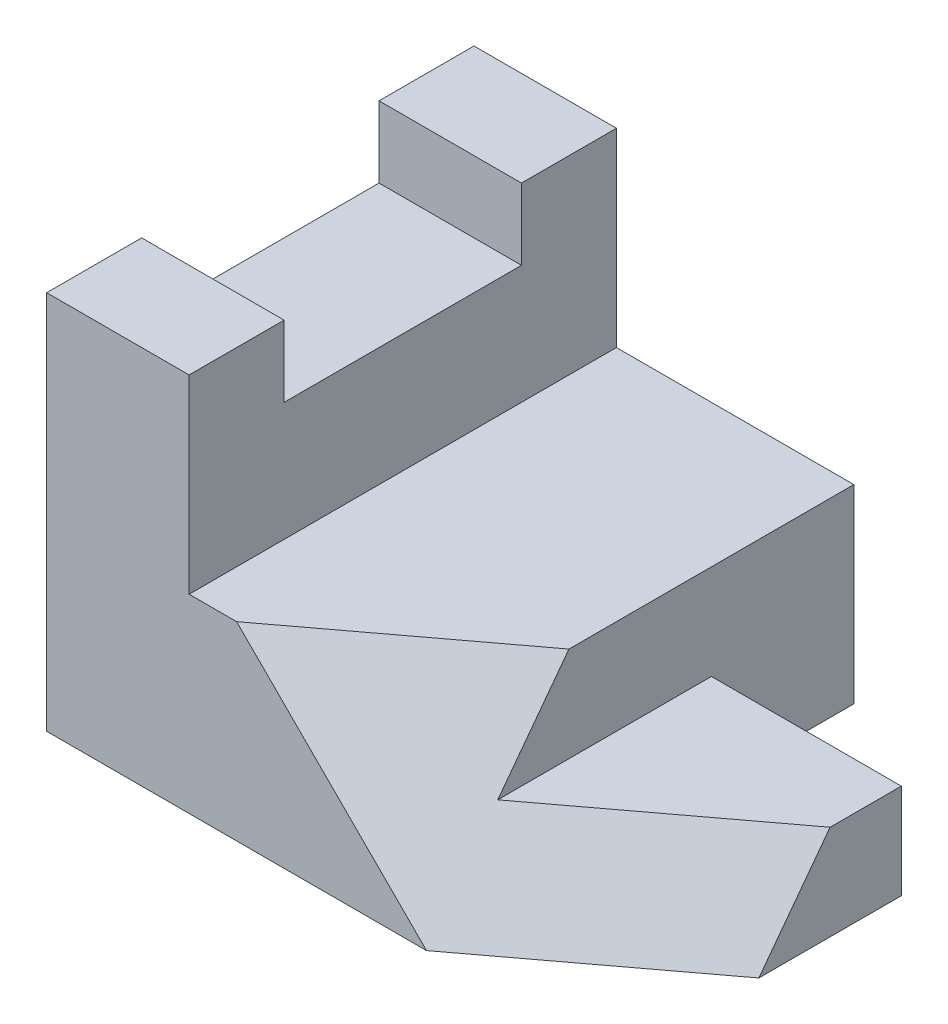
ISO-10303-21;
HEADER;
FILE_DESCRIPTION(('STEP AP214'),'2;1');
FILE_NAME('part.step','',(''),(''),'','','');
FILE_SCHEMA(('AUTOMOTIVE_DESIGN { 1 0 10303 214 1 1 1 1 }'));
ENDSEC;
DATA;
#1=APPLICATION_CONTEXT('core data for automotive mechanical design processes');
#2=APPLICATION_PROTOCOL_DEFINITION('international standard','automotive_design',2000,#1);
#3=PRODUCT_CONTEXT('',#1,'mechanical');
#4=PRODUCT('Part','Part','',(#3));
#5=PRODUCT_RELATED_PRODUCT_CATEGORY('part','',(#4));
#6=PRODUCT_DEFINITION_FORMATION('','',#4);
#7=PRODUCT_DEFINITION_CONTEXT('part definition',#1,'design');
#8=PRODUCT_DEFINITION('design','',#6,#7);
#9=PRODUCT_DEFINITION_SHAPE('','',#8);
#10=(LENGTH_UNIT() NAMED_UNIT(*) SI_UNIT(.MILLI.,.METRE.));
#11=(NAMED_UNIT(*) PLANE_ANGLE_UNIT() SI_UNIT($,.RADIAN.));
#12=(NAMED_UNIT(*) SI_UNIT($,.STERADIAN.) SOLID_ANGLE_UNIT());
#13=UNCERTAINTY_MEASURE_WITH_UNIT(LENGTH_MEASURE(1.E-05),#10,'distance_accuracy_value','');
#14=(GEOMETRIC_REPRESENTATION_CONTEXT(3) GLOBAL_UNCERTAINTY_ASSIGNED_CONTEXT((#13)) GLOBAL_UNIT_ASSIGNED_CONTEXT((#10,
#11,#12)) REPRESENTATION_CONTEXT('',''));
#15=CARTESIAN_POINT('',(0.,0.,0.));
#16=DIRECTION('',(0.,0.,1.));
#17=DIRECTION('',(1.,0.,0.));
#18=AXIS2_PLACEMENT_3D('',#15,#16,#17);
#19=CARTESIAN_POINT('',(-57.15,0.,57.15));
#20=DIRECTION('',(0.,0.,1.));
#21=DIRECTION('',(1.,0.,0.));
#22=AXIS2_PLACEMENT_3D('',#19,#20,#21);
#23=PLANE('',#22);
#24=DIRECTION('',(1.,0.,0.));
#25=VECTOR('',#24,1.);
#26=CARTESIAN_POINT('',(-57.15,0.,57.15));
#27=LINE('',#26,#25);
#28=CARTESIAN_POINT('',(-76.2,0.,57.15));
#29=VERTEX_POINT('',#28);
#30=CARTESIAN_POINT('',(-25.4,0.,57.15));
#31=VERTEX_POINT('',#30);
#32=EDGE_CURVE('E138',#29,#31,#27,.T.);
#33=ORIENTED_EDGE('',*,*,#32,.T.);
#34=DIRECTION('',(-0.707106781186548,0.707106781186548,0.));
#35=VECTOR('',#34,1.);
#36=CARTESIAN_POINT('',(-41.275,15.875,57.15));
#37=LINE('',#36,#35);
#38=CARTESIAN_POINT('',(-50.8,25.4,57.15));
#39=VERTEX_POINT('',#38);
#40=EDGE_CURVE('E59',#31,#39,#37,.T.);
#41=ORIENTED_EDGE('',*,*,#40,.T.);
#42=DIRECTION('',(1.,0.,0.));
#43=VECTOR('',#42,1.);
#44=CARTESIAN_POINT('',(-57.15,25.4,57.15));
#45=LINE('',#44,#43);
#46=CARTESIAN_POINT('',(-57.15,25.4,57.15));
#47=VERTEX_POINT('',#46);
#48=EDGE_CURVE('E225',#47,#39,#45,.T.);
#49=ORIENTED_EDGE('',*,*,#48,.F.);
#50=DIRECTION('',(0.,1.,0.));
#51=VECTOR('',#50,1.);
#52=CARTESIAN_POINT('',(-57.15,0.,57.15));
#53=LINE('',#52,#51);
#54=CARTESIAN_POINT('',(-57.15,50.8,57.15));
#55=VERTEX_POINT('',#54);
#56=EDGE_CURVE('E184',#47,#55,#53,.T.);
#57=ORIENTED_EDGE('',*,*,#56,.T.);
#58=DIRECTION('',(1.,0.,0.));
#59=VECTOR('',#58,1.);
#60=CARTESIAN_POINT('',(-76.2,50.8,57.15));
#61=LINE('',#60,#59);
#62=CARTESIAN_POINT('',(-76.2,50.8,57.15));
#63=VERTEX_POINT('',#62);
#64=EDGE_CURVE('E153',#63,#55,#61,.T.);
#65=ORIENTED_EDGE('',*,*,#64,.F.);
#66=DIRECTION('',(0.,1.,0.));
#67=VECTOR('',#66,1.);
#68=CARTESIAN_POINT('',(-76.2,0.,57.15));
#69=LINE('',#68,#67);
#70=EDGE_CURVE('E151',#29,#63,#69,.T.);
#71=ORIENTED_EDGE('',*,*,#70,.F.);
#72=EDGE_LOOP('',(#33,#41,#49,#57,#65,#71));
#73=FACE_BOUND('',#72,.T.);
#74=ADVANCED_FACE('F36',(#73),#23,.T.);
#75=CARTESIAN_POINT('',(-57.15,25.4,57.15));
#76=DIRECTION('',(0.,1.,0.));
#77=DIRECTION('',(0.,0.,1.));
#78=AXIS2_PLACEMENT_3D('',#75,#76,#77);
#79=PLANE('',#78);
#80=DIRECTION('',(0.8,0.,-0.6));
#81=VECTOR('',#80,1.);
#82=CARTESIAN_POINT('',(-54.864,25.4,60.198));
#83=LINE('',#82,#81);
#84=CARTESIAN_POINT('',(-25.4,25.4,38.1));
#85=VERTEX_POINT('',#84);
#86=EDGE_CURVE('E194',#39,#85,#83,.T.);
#87=ORIENTED_EDGE('',*,*,#86,.T.);
#88=DIRECTION('',(0.,0.,1.));
#89=VECTOR('',#88,1.);
#90=CARTESIAN_POINT('',(-25.4,25.4,0.));
#91=LINE('',#90,#89);
#92=CARTESIAN_POINT('',(-25.4,25.4,0.));
#93=VERTEX_POINT('',#92);
#94=EDGE_CURVE('E198',#93,#85,#91,.T.);
#95=ORIENTED_EDGE('',*,*,#94,.F.);
#96=DIRECTION('',(1.,0.,0.));
#97=VECTOR('',#96,1.);
#98=CARTESIAN_POINT('',(-57.15,25.4,0.));
#99=LINE('',#98,#97);
#100=CARTESIAN_POINT('',(-57.15,25.4,0.));
#101=VERTEX_POINT('',#100);
#102=EDGE_CURVE('E223',#101,#93,#99,.T.);
#103=ORIENTED_EDGE('',*,*,#102,.F.);
#104=DIRECTION('',(0.,0.,1.));
#105=VECTOR('',#104,1.);
#106=CARTESIAN_POINT('',(-57.15,25.4,57.15));
#107=LINE('',#106,#105);
#108=EDGE_CURVE('E148',#101,#47,#107,.T.);
#109=ORIENTED_EDGE('',*,*,#108,.T.);
#110=ORIENTED_EDGE('',*,*,#48,.T.);
#111=EDGE_LOOP('',(#87,#95,#103,#109,#110));
#112=FACE_BOUND('',#111,.T.);
#113=ADVANCED_FACE('F246',(#112),#79,.T.);
#114=CARTESIAN_POINT('',(-57.15,0.,57.15));
#115=DIRECTION('',(0.,-1.,0.));
#116=DIRECTION('',(0.,0.,-1.));
#117=AXIS2_PLACEMENT_3D('',#114,#115,#116);
#118=PLANE('',#117);
#119=DIRECTION('',(0.,0.,-1.));
#120=VECTOR('',#119,1.);
#121=CARTESIAN_POINT('',(0.,0.,57.15));
#122=LINE('',#121,#120);
#123=CARTESIAN_POINT('',(0.,0.,38.1));
#124=VERTEX_POINT('',#123);
#125=CARTESIAN_POINT('',(0.,0.,19.05));
#126=VERTEX_POINT('',#125);
#127=EDGE_CURVE('E210',#124,#126,#122,.T.);
#128=ORIENTED_EDGE('',*,*,#127,.F.);
#129=DIRECTION('',(-0.8,0.,0.6));
#130=VECTOR('',#129,1.);
#131=CARTESIAN_POINT('',(-45.72,0.,72.39));
#132=LINE('',#131,#130);
#133=EDGE_CURVE('E146',#124,#31,#132,.T.);
#134=ORIENTED_EDGE('',*,*,#133,.T.);
#135=ORIENTED_EDGE('',*,*,#32,.F.);
#136=DIRECTION('',(0.,0.,1.));
#137=VECTOR('',#136,1.);
#138=CARTESIAN_POINT('',(-76.2,0.,0.));
#139=LINE('',#138,#137);
#140=CARTESIAN_POINT('',(-76.2,0.,0.));
#141=VERTEX_POINT('',#140);
#142=EDGE_CURVE('E144',#141,#29,#139,.T.);
#143=ORIENTED_EDGE('',*,*,#142,.F.);
#144=DIRECTION('',(1.,0.,0.));
#145=VECTOR('',#144,1.);
#146=CARTESIAN_POINT('',(-57.15,0.,0.));
#147=LINE('',#146,#145);
#148=CARTESIAN_POINT('',(-25.4,0.,0.));
#149=VERTEX_POINT('',#148);
#150=EDGE_CURVE('E147',#141,#149,#147,.T.);
#151=ORIENTED_EDGE('',*,*,#150,.T.);
#152=DIRECTION('',(0.,0.,1.));
#153=VECTOR('',#152,1.);
#154=CARTESIAN_POINT('',(-25.4,0.,0.));
#155=LINE('',#154,#153);
#156=CARTESIAN_POINT('',(-25.4,0.,19.05));
#157=VERTEX_POINT('',#156);
#158=EDGE_CURVE('E199',#149,#157,#155,.T.);
#159=ORIENTED_EDGE('',*,*,#158,.T.);
#160=DIRECTION('',(1.,0.,0.));
#161=VECTOR('',#160,1.);
#162=CARTESIAN_POINT('',(0.,0.,19.05));
#163=LINE('',#162,#161);
#164=EDGE_CURVE('E202',#157,#126,#163,.T.);
#165=ORIENTED_EDGE('',*,*,#164,.T.);
#166=EDGE_LOOP('',(#128,#134,#135,#143,#151,#159,#165));
#167=FACE_BOUND('',#166,.T.);
#168=ADVANCED_FACE('F141',(#167),#118,.T.);
#169=CARTESIAN_POINT('',(0.,0.,0.));
#170=DIRECTION('',(-1.,0.,0.));
#171=DIRECTION('',(0.,0.,1.));
#172=AXIS2_PLACEMENT_3D('',#169,#170,#171);
#173=PLANE('',#172);
#174=DIRECTION('',(0.,1.,0.));
#175=VECTOR('',#174,1.);
#176=CARTESIAN_POINT('',(0.,0.,19.05));
#177=LINE('',#176,#175);
#178=CARTESIAN_POINT('',(0.,12.7,19.05));
#179=VERTEX_POINT('',#178);
#180=EDGE_CURVE('E207',#126,#179,#177,.T.);
#181=ORIENTED_EDGE('',*,*,#180,.T.);
#182=DIRECTION('',(0.,0.,-1.));
#183=VECTOR('',#182,1.);
#184=CARTESIAN_POINT('',(0.,12.7,57.15));
#185=LINE('',#184,#183);
#186=CARTESIAN_POINT('',(0.,12.7,28.575));
#187=VERTEX_POINT('',#186);
#188=EDGE_CURVE('E190',#187,#179,#185,.T.);
#189=ORIENTED_EDGE('',*,*,#188,.F.);
#190=DIRECTION('',(0.,0.8,-0.6));
#191=VECTOR('',#190,1.);
#192=CARTESIAN_POINT('',(0.,18.288,24.384));
#193=LINE('',#192,#191);
#194=EDGE_CURVE('E229',#124,#187,#193,.T.);
#195=ORIENTED_EDGE('',*,*,#194,.F.);
#196=ORIENTED_EDGE('',*,*,#127,.T.);
#197=EDGE_LOOP('',(#181,#189,#195,#196));
#198=FACE_BOUND('',#197,.T.);
#199=ADVANCED_FACE('F240',(#198),#173,.F.);
#200=CARTESIAN_POINT('',(-57.15,0.,0.));
#201=DIRECTION('',(0.,0.,-1.));
#202=DIRECTION('',(-1.,0.,0.));
#203=AXIS2_PLACEMENT_3D('',#200,#201,#202);
#204=PLANE('',#203);
#205=DIRECTION('',(0.,1.,0.));
#206=VECTOR('',#205,1.);
#207=CARTESIAN_POINT('',(-25.4,0.,0.));
#208=LINE('',#207,#206);
#209=EDGE_CURVE('E205',#149,#93,#208,.T.);
#210=ORIENTED_EDGE('',*,*,#209,.F.);
#211=ORIENTED_EDGE('',*,*,#150,.F.);
#212=DIRECTION('',(0.,-1.,0.));
#213=VECTOR('',#212,1.);
#214=CARTESIAN_POINT('',(-76.2,0.,0.));
#215=LINE('',#214,#213);
#216=CARTESIAN_POINT('',(-76.2,50.8,0.));
#217=VERTEX_POINT('',#216);
#218=EDGE_CURVE('E161',#217,#141,#215,.T.);
#219=ORIENTED_EDGE('',*,*,#218,.F.);
#220=DIRECTION('',(1.,0.,0.));
#221=VECTOR('',#220,1.);
#222=CARTESIAN_POINT('',(-76.2,50.8,0.));
#223=LINE('',#222,#221);
#224=CARTESIAN_POINT('',(-57.15,50.8,0.));
#225=VERTEX_POINT('',#224);
#226=EDGE_CURVE('E178',#217,#225,#223,.T.);
#227=ORIENTED_EDGE('',*,*,#226,.T.);
#228=DIRECTION('',(0.,-1.,0.));
#229=VECTOR('',#228,1.);
#230=CARTESIAN_POINT('',(-57.15,0.,0.));
#231=LINE('',#230,#229);
#232=EDGE_CURVE('E162',#225,#101,#231,.T.);
#233=ORIENTED_EDGE('',*,*,#232,.T.);
#234=ORIENTED_EDGE('',*,*,#102,.T.);
#235=EDGE_LOOP('',(#210,#211,#219,#227,#233,#234));
#236=FACE_BOUND('',#235,.T.);
#237=ADVANCED_FACE('F295',(#236),#204,.T.);
#238=CARTESIAN_POINT('',(0.,0.,19.05));
#239=DIRECTION('',(0.,0.,1.));
#240=DIRECTION('',(1.,0.,0.));
#241=AXIS2_PLACEMENT_3D('',#238,#239,#240);
#242=PLANE('',#241);
#243=DIRECTION('',(0.,1.,0.));
#244=VECTOR('',#243,1.);
#245=CARTESIAN_POINT('',(-25.4,0.,19.05));
#246=LINE('',#245,#244);
#247=CARTESIAN_POINT('',(-25.4,12.7,19.05));
#248=VERTEX_POINT('',#247);
#249=EDGE_CURVE('E211',#157,#248,#246,.T.);
#250=ORIENTED_EDGE('',*,*,#249,.T.);
#251=DIRECTION('',(-1.,0.,0.));
#252=VECTOR('',#251,1.);
#253=CARTESIAN_POINT('',(0.,12.7,19.05));
#254=LINE('',#253,#252);
#255=EDGE_CURVE('E188',#179,#248,#254,.T.);
#256=ORIENTED_EDGE('',*,*,#255,.F.);
#257=ORIENTED_EDGE('',*,*,#180,.F.);
#258=ORIENTED_EDGE('',*,*,#164,.F.);
#259=EDGE_LOOP('',(#250,#256,#257,#258));
#260=FACE_BOUND('',#259,.T.);
#261=ADVANCED_FACE('F300',(#260),#242,.F.);
#262=CARTESIAN_POINT('',(-25.4,0.,0.));
#263=DIRECTION('',(-1.,0.,0.));
#264=DIRECTION('',(0.,0.,1.));
#265=AXIS2_PLACEMENT_3D('',#262,#263,#264);
#266=PLANE('',#265);
#267=ORIENTED_EDGE('',*,*,#94,.T.);
#268=DIRECTION('',(0.,-0.8,0.6));
#269=VECTOR('',#268,1.);
#270=CARTESIAN_POINT('',(-25.4,27.432,36.576));
#271=LINE('',#270,#269);
#272=CARTESIAN_POINT('',(-25.4,12.7,47.625));
#273=VERTEX_POINT('',#272);
#274=EDGE_CURVE('E12',#85,#273,#271,.T.);
#275=ORIENTED_EDGE('',*,*,#274,.T.);
#276=DIRECTION('',(0.,0.,-1.));
#277=VECTOR('',#276,1.);
#278=CARTESIAN_POINT('',(-25.4,12.7,57.15));
#279=LINE('',#278,#277);
#280=EDGE_CURVE('E52',#273,#248,#279,.T.);
#281=ORIENTED_EDGE('',*,*,#280,.T.);
#282=ORIENTED_EDGE('',*,*,#249,.F.);
#283=ORIENTED_EDGE('',*,*,#158,.F.);
#284=ORIENTED_EDGE('',*,*,#209,.T.);
#285=EDGE_LOOP('',(#267,#275,#281,#282,#283,#284));
#286=FACE_BOUND('',#285,.T.);
#287=ADVANCED_FACE('F297',(#286),#266,.F.);
#288=CARTESIAN_POINT('',(13.4470588235294,13.4470588235294,17.9294117647059));
#289=DIRECTION('',(0.514495755427526,0.514495755427526,0.685994340570035));
#290=DIRECTION('',(0.8,0.,-0.6));
#291=AXIS2_PLACEMENT_3D('',#288,#289,#290);
#292=PLANE('',#291);
#293=ORIENTED_EDGE('',*,*,#274,.F.);
#294=ORIENTED_EDGE('',*,*,#86,.F.);
#295=ORIENTED_EDGE('',*,*,#40,.F.);
#296=ORIENTED_EDGE('',*,*,#133,.F.);
#297=ORIENTED_EDGE('',*,*,#194,.T.);
#298=DIRECTION('',(0.8,0.,-0.6));
#299=VECTOR('',#298,1.);
#300=CARTESIAN_POINT('',(13.716,12.7,18.288));
#301=LINE('',#300,#299);
#302=EDGE_CURVE('E44',#273,#187,#301,.T.);
#303=ORIENTED_EDGE('',*,*,#302,.F.);
#304=EDGE_LOOP('',(#293,#294,#295,#296,#297,#303));
#305=FACE_BOUND('',#304,.T.);
#306=ADVANCED_FACE('F242',(#305),#292,.T.);
#307=CARTESIAN_POINT('',(0.,12.7,57.15));
#308=DIRECTION('',(0.,-1.,0.));
#309=DIRECTION('',(0.,0.,-1.));
#310=AXIS2_PLACEMENT_3D('',#307,#308,#309);
#311=PLANE('',#310);
#312=ORIENTED_EDGE('',*,*,#302,.T.);
#313=ORIENTED_EDGE('',*,*,#188,.T.);
#314=ORIENTED_EDGE('',*,*,#255,.T.);
#315=ORIENTED_EDGE('',*,*,#280,.F.);
#316=EDGE_LOOP('',(#312,#313,#314,#315));
#317=FACE_BOUND('',#316,.T.);
#318=ADVANCED_FACE('F235',(#317),#311,.F.);
#319=CARTESIAN_POINT('',(-76.2,50.8,57.15));
#320=DIRECTION('',(0.,-1.,0.));
#321=DIRECTION('',(0.,0.,-1.));
#322=AXIS2_PLACEMENT_3D('',#319,#320,#321);
#323=PLANE('',#322);
#324=DIRECTION('',(0.,0.,-1.));
#325=VECTOR('',#324,1.);
#326=CARTESIAN_POINT('',(-57.15,50.8,57.15));
#327=LINE('',#326,#325);
#328=CARTESIAN_POINT('',(-57.15,50.8,44.45));
#329=VERTEX_POINT('',#328);
#330=EDGE_CURVE('E181',#55,#329,#327,.T.);
#331=ORIENTED_EDGE('',*,*,#330,.T.);
#332=DIRECTION('',(1.,0.,0.));
#333=VECTOR('',#332,1.);
#334=CARTESIAN_POINT('',(-76.2,50.8,44.45));
#335=LINE('',#334,#333);
#336=CARTESIAN_POINT('',(-76.2,50.8,44.45));
#337=VERTEX_POINT('',#336);
#338=EDGE_CURVE('E253',#337,#329,#335,.T.);
#339=ORIENTED_EDGE('',*,*,#338,.F.);
#340=DIRECTION('',(0.,0.,-1.));
#341=VECTOR('',#340,1.);
#342=CARTESIAN_POINT('',(-76.2,50.8,57.15));
#343=LINE('',#342,#341);
#344=EDGE_CURVE('E156',#63,#337,#343,.T.);
#345=ORIENTED_EDGE('',*,*,#344,.F.);
#346=ORIENTED_EDGE('',*,*,#64,.T.);
#347=EDGE_LOOP('',(#331,#339,#345,#346));
#348=FACE_BOUND('',#347,.T.);
#349=ADVANCED_FACE('F250',(#348),#323,.F.);
#350=CARTESIAN_POINT('',(-76.2,50.8,44.45));
#351=DIRECTION('',(0.,0.,1.));
#352=DIRECTION('',(0.,-1.,0.));
#353=AXIS2_PLACEMENT_3D('',#350,#351,#352);
#354=PLANE('',#353);
#355=DIRECTION('',(0.,-1.,0.));
#356=VECTOR('',#355,1.);
#357=CARTESIAN_POINT('',(-57.15,50.8,44.45));
#358=LINE('',#357,#356);
#359=CARTESIAN_POINT('',(-57.15,41.275,44.45));
#360=VERTEX_POINT('',#359);
#361=EDGE_CURVE('E257',#329,#360,#358,.T.);
#362=ORIENTED_EDGE('',*,*,#361,.T.);
#363=DIRECTION('',(1.,0.,0.));
#364=VECTOR('',#363,1.);
#365=CARTESIAN_POINT('',(-76.2,41.275,44.45));
#366=LINE('',#365,#364);
#367=CARTESIAN_POINT('',(-76.2,41.275,44.45));
#368=VERTEX_POINT('',#367);
#369=EDGE_CURVE('E276',#368,#360,#366,.T.);
#370=ORIENTED_EDGE('',*,*,#369,.F.);
#371=DIRECTION('',(0.,-1.,0.));
#372=VECTOR('',#371,1.);
#373=CARTESIAN_POINT('',(-76.2,50.8,44.45));
#374=LINE('',#373,#372);
#375=EDGE_CURVE('E169',#337,#368,#374,.T.);
#376=ORIENTED_EDGE('',*,*,#375,.F.);
#377=ORIENTED_EDGE('',*,*,#338,.T.);
#378=EDGE_LOOP('',(#362,#370,#376,#377));
#379=FACE_BOUND('',#378,.T.);
#380=ADVANCED_FACE('F279',(#379),#354,.F.);
#381=CARTESIAN_POINT('',(-76.2,41.275,12.7));
#382=DIRECTION('',(0.,-1.,0.));
#383=DIRECTION('',(0.,0.,-1.));
#384=AXIS2_PLACEMENT_3D('',#381,#382,#383);
#385=PLANE('',#384);
#386=DIRECTION('',(0.,0.,-1.));
#387=VECTOR('',#386,1.);
#388=CARTESIAN_POINT('',(-57.15,41.275,12.7));
#389=LINE('',#388,#387);
#390=CARTESIAN_POINT('',(-57.15,41.275,12.7));
#391=VERTEX_POINT('',#390);
#392=EDGE_CURVE('E258',#360,#391,#389,.T.);
#393=ORIENTED_EDGE('',*,*,#392,.T.);
#394=DIRECTION('',(1.,0.,0.));
#395=VECTOR('',#394,1.);
#396=CARTESIAN_POINT('',(-76.2,41.275,12.7));
#397=LINE('',#396,#395);
#398=CARTESIAN_POINT('',(-76.2,41.275,12.7));
#399=VERTEX_POINT('',#398);
#400=EDGE_CURVE('E273',#399,#391,#397,.T.);
#401=ORIENTED_EDGE('',*,*,#400,.F.);
#402=DIRECTION('',(0.,0.,-1.));
#403=VECTOR('',#402,1.);
#404=CARTESIAN_POINT('',(-76.2,41.275,12.7));
#405=LINE('',#404,#403);
#406=EDGE_CURVE('E171',#368,#399,#405,.T.);
#407=ORIENTED_EDGE('',*,*,#406,.F.);
#408=ORIENTED_EDGE('',*,*,#369,.T.);
#409=EDGE_LOOP('',(#393,#401,#407,#408));
#410=FACE_BOUND('',#409,.T.);
#411=ADVANCED_FACE('F285',(#410),#385,.F.);
#412=CARTESIAN_POINT('',(-76.2,50.8,12.7));
#413=DIRECTION('',(0.,0.,-1.));
#414=DIRECTION('',(0.,1.,0.));
#415=AXIS2_PLACEMENT_3D('',#412,#413,#414);
#416=PLANE('',#415);
#417=DIRECTION('',(0.,1.,0.));
#418=VECTOR('',#417,1.);
#419=CARTESIAN_POINT('',(-57.15,50.8,12.7));
#420=LINE('',#419,#418);
#421=CARTESIAN_POINT('',(-57.15,50.8,12.7));
#422=VERTEX_POINT('',#421);
#423=EDGE_CURVE('E262',#391,#422,#420,.T.);
#424=ORIENTED_EDGE('',*,*,#423,.T.);
#425=DIRECTION('',(1.,0.,0.));
#426=VECTOR('',#425,1.);
#427=CARTESIAN_POINT('',(-76.2,50.8,12.7));
#428=LINE('',#427,#426);
#429=CARTESIAN_POINT('',(-76.2,50.8,12.7));
#430=VERTEX_POINT('',#429);
#431=EDGE_CURVE('E270',#430,#422,#428,.T.);
#432=ORIENTED_EDGE('',*,*,#431,.F.);
#433=DIRECTION('',(0.,1.,0.));
#434=VECTOR('',#433,1.);
#435=CARTESIAN_POINT('',(-76.2,50.8,12.7));
#436=LINE('',#435,#434);
#437=EDGE_CURVE('E173',#399,#430,#436,.T.);
#438=ORIENTED_EDGE('',*,*,#437,.F.);
#439=ORIENTED_EDGE('',*,*,#400,.T.);
#440=EDGE_LOOP('',(#424,#432,#438,#439));
#441=FACE_BOUND('',#440,.T.);
#442=ADVANCED_FACE('F288',(#441),#416,.F.);
#443=CARTESIAN_POINT('',(-76.2,50.8,0.));
#444=DIRECTION('',(0.,-1.,0.));
#445=DIRECTION('',(0.,0.,-1.));
#446=AXIS2_PLACEMENT_3D('',#443,#444,#445);
#447=PLANE('',#446);
#448=DIRECTION('',(0.,0.,-1.));
#449=VECTOR('',#448,1.);
#450=CARTESIAN_POINT('',(-57.15,50.8,0.));
#451=LINE('',#450,#449);
#452=EDGE_CURVE('E165',#422,#225,#451,.T.);
#453=ORIENTED_EDGE('',*,*,#452,.T.);
#454=ORIENTED_EDGE('',*,*,#226,.F.);
#455=DIRECTION('',(0.,0.,-1.));
#456=VECTOR('',#455,1.);
#457=CARTESIAN_POINT('',(-76.2,50.8,0.));
#458=LINE('',#457,#456);
#459=EDGE_CURVE('E175',#430,#217,#458,.T.);
#460=ORIENTED_EDGE('',*,*,#459,.F.);
#461=ORIENTED_EDGE('',*,*,#431,.T.);
#462=EDGE_LOOP('',(#453,#454,#460,#461));
#463=FACE_BOUND('',#462,.T.);
#464=ADVANCED_FACE('F293',(#463),#447,.F.);
#465=CARTESIAN_POINT('',(-76.2,0.,0.));
#466=DIRECTION('',(-1.,0.,0.));
#467=DIRECTION('',(0.,0.,1.));
#468=AXIS2_PLACEMENT_3D('',#465,#466,#467);
#469=PLANE('',#468);
#470=ORIENTED_EDGE('',*,*,#142,.T.);
#471=ORIENTED_EDGE('',*,*,#70,.T.);
#472=ORIENTED_EDGE('',*,*,#344,.T.);
#473=ORIENTED_EDGE('',*,*,#375,.T.);
#474=ORIENTED_EDGE('',*,*,#406,.T.);
#475=ORIENTED_EDGE('',*,*,#437,.T.);
#476=ORIENTED_EDGE('',*,*,#459,.T.);
#477=ORIENTED_EDGE('',*,*,#218,.T.);
#478=EDGE_LOOP('',(#470,#471,#472,#473,#474,#475,#476,#477));
#479=FACE_BOUND('',#478,.T.);
#480=ADVANCED_FACE('F159',(#479),#469,.T.);
#481=CARTESIAN_POINT('',(-57.15,0.,0.));
#482=DIRECTION('',(-1.,0.,0.));
#483=DIRECTION('',(0.,0.,1.));
#484=AXIS2_PLACEMENT_3D('',#481,#482,#483);
#485=PLANE('',#484);
#486=ORIENTED_EDGE('',*,*,#108,.F.);
#487=ORIENTED_EDGE('',*,*,#232,.F.);
#488=ORIENTED_EDGE('',*,*,#452,.F.);
#489=ORIENTED_EDGE('',*,*,#423,.F.);
#490=ORIENTED_EDGE('',*,*,#392,.F.);
#491=ORIENTED_EDGE('',*,*,#361,.F.);
#492=ORIENTED_EDGE('',*,*,#330,.F.);
#493=ORIENTED_EDGE('',*,*,#56,.F.);
#494=EDGE_LOOP('',(#486,#487,#488,#489,#490,#491,#492,#493));
#495=FACE_BOUND('',#494,.T.);
#496=ADVANCED_FACE('F255',(#495),#485,.F.);
#497=CLOSED_SHELL('',(#74,#113,#168,#199,#237,#261,#287,#306,#318,#349,#380,#411,#442,#464,#480,#496));
#498=MANIFOLD_SOLID_BREP('B2',#497);
#499=ADVANCED_BREP_SHAPE_REPRESENTATION('',(#18,#498),#14);
#500=SHAPE_DEFINITION_REPRESENTATION(#9,#499);
ENDSEC;
END-ISO-10303-21;
